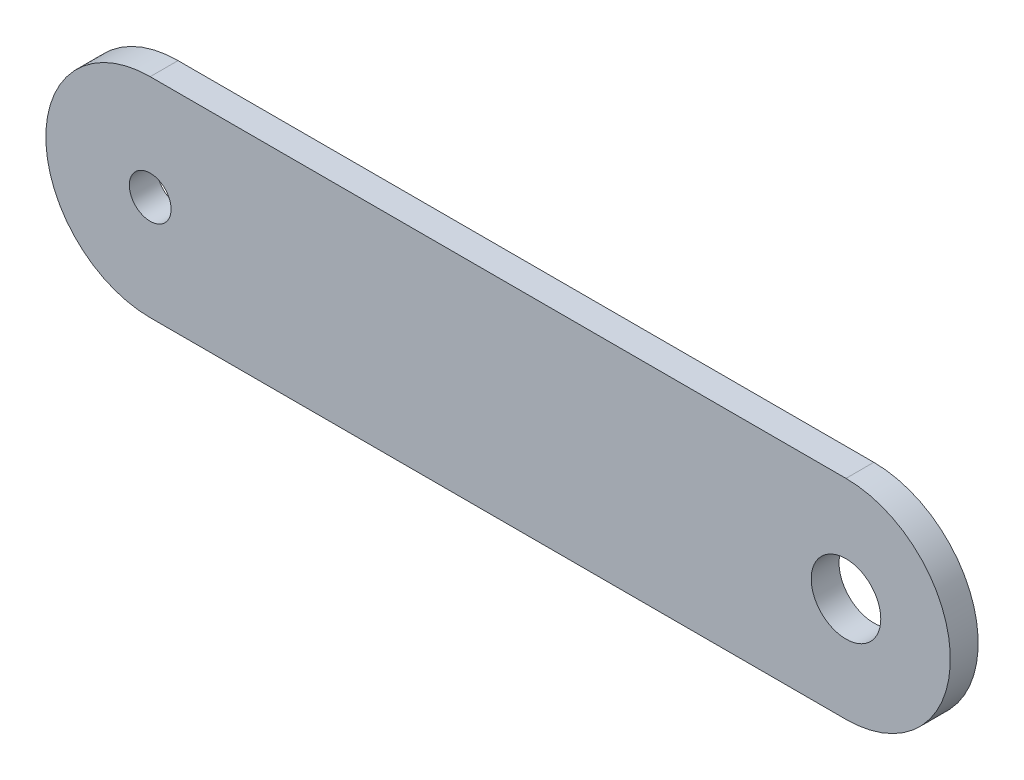
ISO-10303-21;
HEADER;
FILE_DESCRIPTION(('STEP AP214'),'2;1');
FILE_NAME('part.step','',(''),(''),'','','');
FILE_SCHEMA(('AUTOMOTIVE_DESIGN { 1 0 10303 214 1 1 1 1 }'));
ENDSEC;
DATA;
#1=APPLICATION_CONTEXT('core data for automotive mechanical design processes');
#2=APPLICATION_PROTOCOL_DEFINITION('international standard','automotive_design',2000,#1);
#3=PRODUCT_CONTEXT('',#1,'mechanical');
#4=PRODUCT('Part','Part','',(#3));
#5=PRODUCT_RELATED_PRODUCT_CATEGORY('part','',(#4));
#6=PRODUCT_DEFINITION_FORMATION('','',#4);
#7=PRODUCT_DEFINITION_CONTEXT('part definition',#1,'design');
#8=PRODUCT_DEFINITION('design','',#6,#7);
#9=PRODUCT_DEFINITION_SHAPE('','',#8);
#10=(LENGTH_UNIT() NAMED_UNIT(*) SI_UNIT(.MILLI.,.METRE.));
#11=(NAMED_UNIT(*) PLANE_ANGLE_UNIT() SI_UNIT($,.RADIAN.));
#12=(NAMED_UNIT(*) SI_UNIT($,.STERADIAN.) SOLID_ANGLE_UNIT());
#13=UNCERTAINTY_MEASURE_WITH_UNIT(LENGTH_MEASURE(1.E-05),#10,'distance_accuracy_value','');
#14=(GEOMETRIC_REPRESENTATION_CONTEXT(3) GLOBAL_UNCERTAINTY_ASSIGNED_CONTEXT((#13)) GLOBAL_UNIT_ASSIGNED_CONTEXT((#10,
#11,#12)) REPRESENTATION_CONTEXT('',''));
#15=CARTESIAN_POINT('',(0.,0.,0.));
#16=DIRECTION('',(0.,0.,1.));
#17=DIRECTION('',(1.,0.,0.));
#18=AXIS2_PLACEMENT_3D('',#15,#16,#17);
#19=CARTESIAN_POINT('',(25.,0.,-2.));
#20=DIRECTION('',(0.,0.,1.));
#21=DIRECTION('',(1.,0.,0.));
#22=AXIS2_PLACEMENT_3D('',#19,#20,#21);
#23=CYLINDRICAL_SURFACE('',#22,7.5);
#24=CARTESIAN_POINT('',(25.,0.,0.));
#25=DIRECTION('',(0.,0.,1.));
#26=DIRECTION('',(1.,0.,0.));
#27=AXIS2_PLACEMENT_3D('',#24,#25,#26);
#28=CIRCLE('',#27,7.5);
#29=CARTESIAN_POINT('',(25.,-7.5,0.));
#30=VERTEX_POINT('',#29);
#31=CARTESIAN_POINT('',(25.,7.5,0.));
#32=VERTEX_POINT('',#31);
#33=EDGE_CURVE('E101',#30,#32,#28,.T.);
#34=ORIENTED_EDGE('',*,*,#33,.F.);
#35=DIRECTION('',(0.,0.,1.));
#36=VECTOR('',#35,1.);
#37=CARTESIAN_POINT('',(25.,-7.5,-2.));
#38=LINE('',#37,#36);
#39=CARTESIAN_POINT('',(25.,-7.5,-2.));
#40=VERTEX_POINT('',#39);
#41=EDGE_CURVE('E11',#40,#30,#38,.T.);
#42=ORIENTED_EDGE('',*,*,#41,.F.);
#43=CARTESIAN_POINT('',(25.,0.,-2.));
#44=DIRECTION('',(0.,0.,1.));
#45=DIRECTION('',(1.,0.,0.));
#46=AXIS2_PLACEMENT_3D('',#43,#44,#45);
#47=CIRCLE('',#46,7.5);
#48=CARTESIAN_POINT('',(25.,7.5,-2.));
#49=VERTEX_POINT('',#48);
#50=EDGE_CURVE('E94',#40,#49,#47,.T.);
#51=ORIENTED_EDGE('',*,*,#50,.T.);
#52=DIRECTION('',(0.,0.,1.));
#53=VECTOR('',#52,1.);
#54=CARTESIAN_POINT('',(25.,7.5,-2.));
#55=LINE('',#54,#53);
#56=EDGE_CURVE('E39',#49,#32,#55,.T.);
#57=ORIENTED_EDGE('',*,*,#56,.T.);
#58=EDGE_LOOP('',(#34,#42,#51,#57));
#59=FACE_BOUND('',#58,.T.);
#60=ADVANCED_FACE('F36',(#59),#23,.T.);
#61=CARTESIAN_POINT('',(-25.,-7.5,-2.));
#62=DIRECTION('',(0.,-1.,0.));
#63=DIRECTION('',(0.,0.,-1.));
#64=AXIS2_PLACEMENT_3D('',#61,#62,#63);
#65=PLANE('',#64);
#66=DIRECTION('',(1.,0.,0.));
#67=VECTOR('',#66,1.);
#68=CARTESIAN_POINT('',(-25.,-7.5,0.));
#69=LINE('',#68,#67);
#70=CARTESIAN_POINT('',(-25.,-7.5,0.));
#71=VERTEX_POINT('',#70);
#72=EDGE_CURVE('E96',#71,#30,#69,.T.);
#73=ORIENTED_EDGE('',*,*,#72,.F.);
#74=DIRECTION('',(0.,0.,1.));
#75=VECTOR('',#74,1.);
#76=CARTESIAN_POINT('',(-25.,-7.5,-2.));
#77=LINE('',#76,#75);
#78=CARTESIAN_POINT('',(-25.,-7.5,-2.));
#79=VERTEX_POINT('',#78);
#80=EDGE_CURVE('E45',#79,#71,#77,.T.);
#81=ORIENTED_EDGE('',*,*,#80,.F.);
#82=DIRECTION('',(1.,0.,0.));
#83=VECTOR('',#82,1.);
#84=CARTESIAN_POINT('',(-25.,-7.5,-2.));
#85=LINE('',#84,#83);
#86=EDGE_CURVE('E91',#79,#40,#85,.T.);
#87=ORIENTED_EDGE('',*,*,#86,.T.);
#88=ORIENTED_EDGE('',*,*,#41,.T.);
#89=EDGE_LOOP('',(#73,#81,#87,#88));
#90=FACE_BOUND('',#89,.T.);
#91=ADVANCED_FACE('F112',(#90),#65,.T.);
#92=CARTESIAN_POINT('',(-25.,0.,-2.));
#93=DIRECTION('',(0.,0.,1.));
#94=DIRECTION('',(1.,0.,0.));
#95=AXIS2_PLACEMENT_3D('',#92,#93,#94);
#96=CYLINDRICAL_SURFACE('',#95,7.5);
#97=CARTESIAN_POINT('',(-25.,0.,0.));
#98=DIRECTION('',(0.,0.,1.));
#99=DIRECTION('',(1.,0.,0.));
#100=AXIS2_PLACEMENT_3D('',#97,#98,#99);
#101=CIRCLE('',#100,7.5);
#102=CARTESIAN_POINT('',(-25.,7.5,0.));
#103=VERTEX_POINT('',#102);
#104=EDGE_CURVE('E86',#103,#71,#101,.T.);
#105=ORIENTED_EDGE('',*,*,#104,.F.);
#106=DIRECTION('',(0.,0.,1.));
#107=VECTOR('',#106,1.);
#108=CARTESIAN_POINT('',(-25.,7.5,-2.));
#109=LINE('',#108,#107);
#110=CARTESIAN_POINT('',(-25.,7.5,-2.));
#111=VERTEX_POINT('',#110);
#112=EDGE_CURVE('E81',#111,#103,#109,.T.);
#113=ORIENTED_EDGE('',*,*,#112,.F.);
#114=CARTESIAN_POINT('',(-25.,0.,-2.));
#115=DIRECTION('',(0.,0.,1.));
#116=DIRECTION('',(1.,0.,0.));
#117=AXIS2_PLACEMENT_3D('',#114,#115,#116);
#118=CIRCLE('',#117,7.5);
#119=EDGE_CURVE('E84',#111,#79,#118,.T.);
#120=ORIENTED_EDGE('',*,*,#119,.T.);
#121=ORIENTED_EDGE('',*,*,#80,.T.);
#122=EDGE_LOOP('',(#105,#113,#120,#121));
#123=FACE_BOUND('',#122,.T.);
#124=ADVANCED_FACE('F83',(#123),#96,.T.);
#125=CARTESIAN_POINT('',(-25.,7.5,-2.));
#126=DIRECTION('',(0.,1.,0.));
#127=DIRECTION('',(0.,0.,1.));
#128=AXIS2_PLACEMENT_3D('',#125,#126,#127);
#129=PLANE('',#128);
#130=DIRECTION('',(-1.,0.,0.));
#131=VECTOR('',#130,1.);
#132=CARTESIAN_POINT('',(-25.,7.5,0.));
#133=LINE('',#132,#131);
#134=EDGE_CURVE('E104',#32,#103,#133,.T.);
#135=ORIENTED_EDGE('',*,*,#134,.F.);
#136=ORIENTED_EDGE('',*,*,#56,.F.);
#137=DIRECTION('',(-1.,0.,0.));
#138=VECTOR('',#137,1.);
#139=CARTESIAN_POINT('',(-25.,7.5,-2.));
#140=LINE('',#139,#138);
#141=EDGE_CURVE('E90',#49,#111,#140,.T.);
#142=ORIENTED_EDGE('',*,*,#141,.T.);
#143=ORIENTED_EDGE('',*,*,#112,.T.);
#144=EDGE_LOOP('',(#135,#136,#142,#143));
#145=FACE_BOUND('',#144,.T.);
#146=ADVANCED_FACE('F93',(#145),#129,.T.);
#147=CARTESIAN_POINT('',(25.,0.,-2.));
#148=DIRECTION('',(0.,0.,1.));
#149=DIRECTION('',(1.,0.,0.));
#150=AXIS2_PLACEMENT_3D('',#147,#148,#149);
#151=PLANE('',#150);
#152=CARTESIAN_POINT('',(-25.,0.,-2.));
#153=DIRECTION('',(0.,0.,1.));
#154=DIRECTION('',(1.,0.,0.));
#155=AXIS2_PLACEMENT_3D('',#152,#153,#154);
#156=CIRCLE('',#155,1.5);
#157=CARTESIAN_POINT('',(-23.5,0.,-2.));
#158=VERTEX_POINT('',#157);
#159=EDGE_CURVE('E105',#158,#158,#156,.F.);
#160=ORIENTED_EDGE('',*,*,#159,.F.);
#161=EDGE_LOOP('',(#160));
#162=FACE_BOUND('',#161,.T.);
#163=CARTESIAN_POINT('',(25.,0.,-2.));
#164=DIRECTION('',(0.,0.,1.));
#165=DIRECTION('',(1.,0.,0.));
#166=AXIS2_PLACEMENT_3D('',#163,#164,#165);
#167=CIRCLE('',#166,2.5);
#168=CARTESIAN_POINT('',(27.5,0.,-2.));
#169=VERTEX_POINT('',#168);
#170=EDGE_CURVE('E149',#169,#169,#167,.F.);
#171=ORIENTED_EDGE('',*,*,#170,.F.);
#172=EDGE_LOOP('',(#171));
#173=FACE_BOUND('',#172,.T.);
#174=ORIENTED_EDGE('',*,*,#50,.F.);
#175=ORIENTED_EDGE('',*,*,#86,.F.);
#176=ORIENTED_EDGE('',*,*,#119,.F.);
#177=ORIENTED_EDGE('',*,*,#141,.F.);
#178=EDGE_LOOP('',(#174,#175,#176,#177));
#179=FACE_BOUND('',#178,.T.);
#180=ADVANCED_FACE('F89',(#162,#173,#179),#151,.F.);
#181=CARTESIAN_POINT('',(25.,0.,0.));
#182=DIRECTION('',(0.,0.,1.));
#183=DIRECTION('',(1.,0.,0.));
#184=AXIS2_PLACEMENT_3D('',#181,#182,#183);
#185=PLANE('',#184);
#186=CARTESIAN_POINT('',(-25.,0.,0.));
#187=DIRECTION('',(0.,0.,1.));
#188=DIRECTION('',(1.,0.,0.));
#189=AXIS2_PLACEMENT_3D('',#186,#187,#188);
#190=CIRCLE('',#189,1.5);
#191=CARTESIAN_POINT('',(-23.5,0.,0.));
#192=VERTEX_POINT('',#191);
#193=EDGE_CURVE('E146',#192,#192,#190,.T.);
#194=ORIENTED_EDGE('',*,*,#193,.F.);
#195=EDGE_LOOP('',(#194));
#196=FACE_BOUND('',#195,.T.);
#197=CARTESIAN_POINT('',(25.,0.,0.));
#198=DIRECTION('',(0.,0.,1.));
#199=DIRECTION('',(1.,0.,0.));
#200=AXIS2_PLACEMENT_3D('',#197,#198,#199);
#201=CIRCLE('',#200,2.5);
#202=CARTESIAN_POINT('',(27.5,0.,0.));
#203=VERTEX_POINT('',#202);
#204=EDGE_CURVE('E152',#203,#203,#201,.T.);
#205=ORIENTED_EDGE('',*,*,#204,.F.);
#206=EDGE_LOOP('',(#205));
#207=FACE_BOUND('',#206,.T.);
#208=ORIENTED_EDGE('',*,*,#33,.T.);
#209=ORIENTED_EDGE('',*,*,#134,.T.);
#210=ORIENTED_EDGE('',*,*,#104,.T.);
#211=ORIENTED_EDGE('',*,*,#72,.T.);
#212=EDGE_LOOP('',(#208,#209,#210,#211));
#213=FACE_BOUND('',#212,.T.);
#214=ADVANCED_FACE('F111',(#196,#207,#213),#185,.T.);
#215=CARTESIAN_POINT('',(25.,0.,-2.001));
#216=DIRECTION('',(0.,0.,1.));
#217=DIRECTION('',(1.,0.,0.));
#218=AXIS2_PLACEMENT_3D('',#215,#216,#217);
#219=CYLINDRICAL_SURFACE('',#218,2.5);
#220=ORIENTED_EDGE('',*,*,#204,.T.);
#221=EDGE_LOOP('',(#220));
#222=FACE_BOUND('',#221,.T.);
#223=ORIENTED_EDGE('',*,*,#170,.T.);
#224=EDGE_LOOP('',(#223));
#225=FACE_BOUND('',#224,.T.);
#226=ADVANCED_FACE('F130',(#222,#225),#219,.F.);
#227=CARTESIAN_POINT('',(-25.,0.,-2.001));
#228=DIRECTION('',(0.,0.,1.));
#229=DIRECTION('',(1.,0.,0.));
#230=AXIS2_PLACEMENT_3D('',#227,#228,#229);
#231=CYLINDRICAL_SURFACE('',#230,1.5);
#232=ORIENTED_EDGE('',*,*,#193,.T.);
#233=EDGE_LOOP('',(#232));
#234=FACE_BOUND('',#233,.T.);
#235=ORIENTED_EDGE('',*,*,#159,.T.);
#236=EDGE_LOOP('',(#235));
#237=FACE_BOUND('',#236,.T.);
#238=ADVANCED_FACE('F137',(#234,#237),#231,.F.);
#239=CLOSED_SHELL('',(#60,#91,#124,#146,#180,#214,#226,#238));
#240=MANIFOLD_SOLID_BREP('B2',#239);
#241=ADVANCED_BREP_SHAPE_REPRESENTATION('',(#18,#240),#14);
#242=SHAPE_DEFINITION_REPRESENTATION(#9,#241);
ENDSEC;
END-ISO-10303-21;
